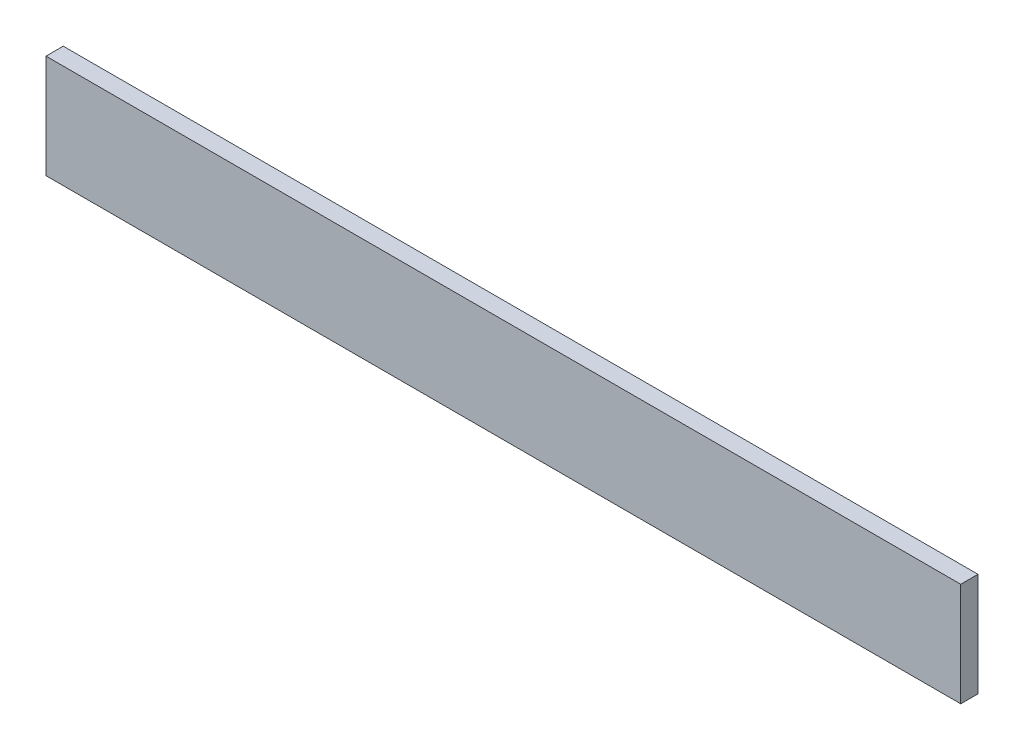
ISO-10303-21;
HEADER;
FILE_DESCRIPTION(('STEP AP214'),'2;1');
FILE_NAME('part.step','',(''),(''),'','','');
FILE_SCHEMA(('AUTOMOTIVE_DESIGN { 1 0 10303 214 1 1 1 1 }'));
ENDSEC;
DATA;
#1=APPLICATION_CONTEXT('core data for automotive mechanical design processes');
#2=APPLICATION_PROTOCOL_DEFINITION('international standard','automotive_design',2000,#1);
#3=PRODUCT_CONTEXT('',#1,'mechanical');
#4=PRODUCT('Part','Part','',(#3));
#5=PRODUCT_RELATED_PRODUCT_CATEGORY('part','',(#4));
#6=PRODUCT_DEFINITION_FORMATION('','',#4);
#7=PRODUCT_DEFINITION_CONTEXT('part definition',#1,'design');
#8=PRODUCT_DEFINITION('design','',#6,#7);
#9=PRODUCT_DEFINITION_SHAPE('','',#8);
#10=(LENGTH_UNIT() NAMED_UNIT(*) SI_UNIT(.MILLI.,.METRE.));
#11=(NAMED_UNIT(*) PLANE_ANGLE_UNIT() SI_UNIT($,.RADIAN.));
#12=(NAMED_UNIT(*) SI_UNIT($,.STERADIAN.) SOLID_ANGLE_UNIT());
#13=UNCERTAINTY_MEASURE_WITH_UNIT(LENGTH_MEASURE(1.E-05),#10,'distance_accuracy_value','');
#14=(GEOMETRIC_REPRESENTATION_CONTEXT(3) GLOBAL_UNCERTAINTY_ASSIGNED_CONTEXT((#13)) GLOBAL_UNIT_ASSIGNED_CONTEXT((#10,
#11,#12)) REPRESENTATION_CONTEXT('',''));
#15=CARTESIAN_POINT('',(0.,0.,0.));
#16=DIRECTION('',(0.,0.,1.));
#17=DIRECTION('',(1.,0.,0.));
#18=AXIS2_PLACEMENT_3D('',#15,#16,#17);
#19=CARTESIAN_POINT('',(0.,0.,5.));
#20=DIRECTION('',(1.,0.,0.));
#21=DIRECTION('',(0.,0.,-1.));
#22=AXIS2_PLACEMENT_3D('',#19,#20,#21);
#23=PLANE('',#22);
#24=DIRECTION('',(0.,-1.,0.));
#25=VECTOR('',#24,1.);
#26=CARTESIAN_POINT('',(0.,0.,0.));
#27=LINE('',#26,#25);
#28=CARTESIAN_POINT('',(0.,30.,0.));
#29=VERTEX_POINT('',#28);
#30=CARTESIAN_POINT('',(0.,0.,0.));
#31=VERTEX_POINT('',#30);
#32=EDGE_CURVE('E98',#29,#31,#27,.T.);
#33=ORIENTED_EDGE('',*,*,#32,.T.);
#34=DIRECTION('',(0.,0.,-1.));
#35=VECTOR('',#34,1.);
#36=CARTESIAN_POINT('',(0.,0.,5.));
#37=LINE('',#36,#35);
#38=CARTESIAN_POINT('',(0.,0.,5.));
#39=VERTEX_POINT('',#38);
#40=EDGE_CURVE('E11',#39,#31,#37,.T.);
#41=ORIENTED_EDGE('',*,*,#40,.F.);
#42=DIRECTION('',(0.,-1.,0.));
#43=VECTOR('',#42,1.);
#44=CARTESIAN_POINT('',(0.,0.,5.));
#45=LINE('',#44,#43);
#46=CARTESIAN_POINT('',(0.,30.,5.));
#47=VERTEX_POINT('',#46);
#48=EDGE_CURVE('E86',#47,#39,#45,.T.);
#49=ORIENTED_EDGE('',*,*,#48,.F.);
#50=DIRECTION('',(0.,0.,-1.));
#51=VECTOR('',#50,1.);
#52=CARTESIAN_POINT('',(0.,30.,5.));
#53=LINE('',#52,#51);
#54=EDGE_CURVE('E94',#47,#29,#53,.T.);
#55=ORIENTED_EDGE('',*,*,#54,.T.);
#56=EDGE_LOOP('',(#33,#41,#49,#55));
#57=FACE_BOUND('',#56,.T.);
#58=ADVANCED_FACE('F35',(#57),#23,.F.);
#59=CARTESIAN_POINT('',(0.,0.,5.));
#60=DIRECTION('',(0.,1.,0.));
#61=DIRECTION('',(0.,0.,1.));
#62=AXIS2_PLACEMENT_3D('',#59,#60,#61);
#63=PLANE('',#62);
#64=DIRECTION('',(1.,0.,0.));
#65=VECTOR('',#64,1.);
#66=CARTESIAN_POINT('',(0.,0.,0.));
#67=LINE('',#66,#65);
#68=CARTESIAN_POINT('',(265.,0.,0.));
#69=VERTEX_POINT('',#68);
#70=EDGE_CURVE('E90',#31,#69,#67,.T.);
#71=ORIENTED_EDGE('',*,*,#70,.T.);
#72=DIRECTION('',(0.,0.,-1.));
#73=VECTOR('',#72,1.);
#74=CARTESIAN_POINT('',(265.,0.,5.));
#75=LINE('',#74,#73);
#76=CARTESIAN_POINT('',(265.,0.,5.));
#77=VERTEX_POINT('',#76);
#78=EDGE_CURVE('E43',#77,#69,#75,.T.);
#79=ORIENTED_EDGE('',*,*,#78,.F.);
#80=DIRECTION('',(1.,0.,0.));
#81=VECTOR('',#80,1.);
#82=CARTESIAN_POINT('',(0.,0.,5.));
#83=LINE('',#82,#81);
#84=EDGE_CURVE('E81',#39,#77,#83,.T.);
#85=ORIENTED_EDGE('',*,*,#84,.F.);
#86=ORIENTED_EDGE('',*,*,#40,.T.);
#87=EDGE_LOOP('',(#71,#79,#85,#86));
#88=FACE_BOUND('',#87,.T.);
#89=ADVANCED_FACE('F89',(#88),#63,.F.);
#90=CARTESIAN_POINT('',(265.,0.,5.));
#91=DIRECTION('',(-1.,0.,0.));
#92=DIRECTION('',(0.,0.,1.));
#93=AXIS2_PLACEMENT_3D('',#90,#91,#92);
#94=PLANE('',#93);
#95=DIRECTION('',(0.,1.,0.));
#96=VECTOR('',#95,1.);
#97=CARTESIAN_POINT('',(265.,0.,0.));
#98=LINE('',#97,#96);
#99=CARTESIAN_POINT('',(265.,30.,0.));
#100=VERTEX_POINT('',#99);
#101=EDGE_CURVE('E68',#69,#100,#98,.T.);
#102=ORIENTED_EDGE('',*,*,#101,.T.);
#103=DIRECTION('',(0.,0.,-1.));
#104=VECTOR('',#103,1.);
#105=CARTESIAN_POINT('',(265.,30.,5.));
#106=LINE('',#105,#104);
#107=CARTESIAN_POINT('',(265.,30.,5.));
#108=VERTEX_POINT('',#107);
#109=EDGE_CURVE('E91',#108,#100,#106,.T.);
#110=ORIENTED_EDGE('',*,*,#109,.F.);
#111=DIRECTION('',(0.,1.,0.));
#112=VECTOR('',#111,1.);
#113=CARTESIAN_POINT('',(265.,0.,5.));
#114=LINE('',#113,#112);
#115=EDGE_CURVE('E84',#77,#108,#114,.T.);
#116=ORIENTED_EDGE('',*,*,#115,.F.);
#117=ORIENTED_EDGE('',*,*,#78,.T.);
#118=EDGE_LOOP('',(#102,#110,#116,#117));
#119=FACE_BOUND('',#118,.T.);
#120=ADVANCED_FACE('F92',(#119),#94,.F.);
#121=CARTESIAN_POINT('',(0.,30.,5.));
#122=DIRECTION('',(0.,-1.,0.));
#123=DIRECTION('',(0.,0.,-1.));
#124=AXIS2_PLACEMENT_3D('',#121,#122,#123);
#125=PLANE('',#124);
#126=DIRECTION('',(-1.,0.,0.));
#127=VECTOR('',#126,1.);
#128=CARTESIAN_POINT('',(0.,30.,0.));
#129=LINE('',#128,#127);
#130=EDGE_CURVE('E74',#100,#29,#129,.T.);
#131=ORIENTED_EDGE('',*,*,#130,.T.);
#132=ORIENTED_EDGE('',*,*,#54,.F.);
#133=DIRECTION('',(-1.,0.,0.));
#134=VECTOR('',#133,1.);
#135=CARTESIAN_POINT('',(0.,30.,5.));
#136=LINE('',#135,#134);
#137=EDGE_CURVE('E51',#108,#47,#136,.T.);
#138=ORIENTED_EDGE('',*,*,#137,.F.);
#139=ORIENTED_EDGE('',*,*,#109,.T.);
#140=EDGE_LOOP('',(#131,#132,#138,#139));
#141=FACE_BOUND('',#140,.T.);
#142=ADVANCED_FACE('F105',(#141),#125,.F.);
#143=CARTESIAN_POINT('',(0.,0.,5.));
#144=DIRECTION('',(0.,0.,-1.));
#145=DIRECTION('',(-1.,0.,0.));
#146=AXIS2_PLACEMENT_3D('',#143,#144,#145);
#147=PLANE('',#146);
#148=ORIENTED_EDGE('',*,*,#48,.T.);
#149=ORIENTED_EDGE('',*,*,#84,.T.);
#150=ORIENTED_EDGE('',*,*,#115,.T.);
#151=ORIENTED_EDGE('',*,*,#137,.T.);
#152=EDGE_LOOP('',(#148,#149,#150,#151));
#153=FACE_BOUND('',#152,.T.);
#154=ADVANCED_FACE('F82',(#153),#147,.F.);
#155=CARTESIAN_POINT('',(0.,0.,0.));
#156=DIRECTION('',(0.,0.,-1.));
#157=DIRECTION('',(-1.,0.,0.));
#158=AXIS2_PLACEMENT_3D('',#155,#156,#157);
#159=PLANE('',#158);
#160=ORIENTED_EDGE('',*,*,#32,.F.);
#161=ORIENTED_EDGE('',*,*,#130,.F.);
#162=ORIENTED_EDGE('',*,*,#101,.F.);
#163=ORIENTED_EDGE('',*,*,#70,.F.);
#164=EDGE_LOOP('',(#160,#161,#162,#163));
#165=FACE_BOUND('',#164,.T.);
#166=ADVANCED_FACE('F108',(#165),#159,.T.);
#167=CLOSED_SHELL('',(#58,#89,#120,#142,#154,#166));
#168=MANIFOLD_SOLID_BREP('B2',#167);
#169=ADVANCED_BREP_SHAPE_REPRESENTATION('',(#18,#168),#14);
#170=SHAPE_DEFINITION_REPRESENTATION(#9,#169);
ENDSEC;
END-ISO-10303-21;
